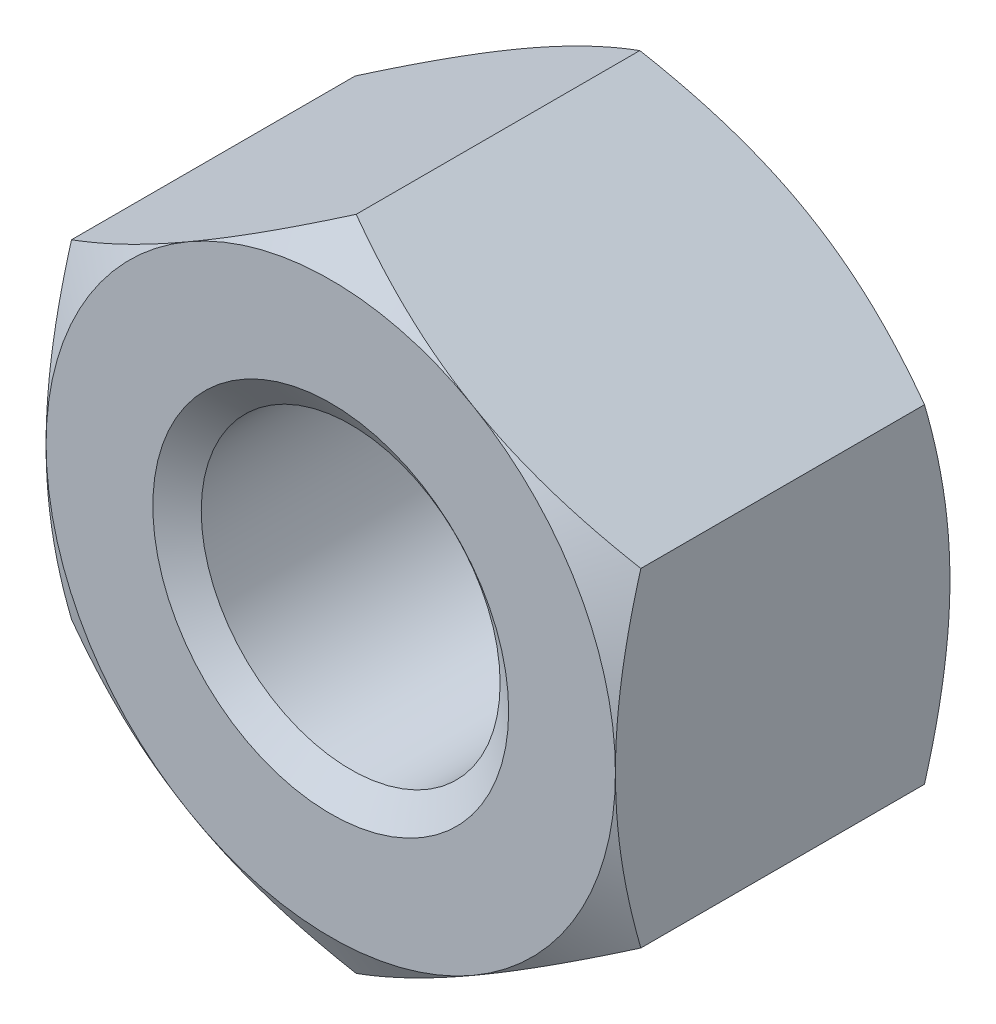
ISO-10303-21;
HEADER;
FILE_DESCRIPTION(('STEP AP214'),'2;1');
FILE_NAME('part.step','',(''),(''),'','','');
FILE_SCHEMA(('AUTOMOTIVE_DESIGN { 1 0 10303 214 1 1 1 1 }'));
ENDSEC;
DATA;
#1=APPLICATION_CONTEXT('core data for automotive mechanical design processes');
#2=APPLICATION_PROTOCOL_DEFINITION('international standard','automotive_design',2000,#1);
#3=PRODUCT_CONTEXT('',#1,'mechanical');
#4=PRODUCT('Part','Part','',(#3));
#5=PRODUCT_RELATED_PRODUCT_CATEGORY('part','',(#4));
#6=PRODUCT_DEFINITION_FORMATION('','',#4);
#7=PRODUCT_DEFINITION_CONTEXT('part definition',#1,'design');
#8=PRODUCT_DEFINITION('design','',#6,#7);
#9=PRODUCT_DEFINITION_SHAPE('','',#8);
#10=(LENGTH_UNIT() NAMED_UNIT(*) SI_UNIT(.MILLI.,.METRE.));
#11=(NAMED_UNIT(*) PLANE_ANGLE_UNIT() SI_UNIT($,.RADIAN.));
#12=(NAMED_UNIT(*) SI_UNIT($,.STERADIAN.) SOLID_ANGLE_UNIT());
#13=UNCERTAINTY_MEASURE_WITH_UNIT(LENGTH_MEASURE(1.E-05),#10,'distance_accuracy_value','');
#14=(GEOMETRIC_REPRESENTATION_CONTEXT(3) GLOBAL_UNCERTAINTY_ASSIGNED_CONTEXT((#13)) GLOBAL_UNIT_ASSIGNED_CONTEXT((#10,
#11,#12)) REPRESENTATION_CONTEXT('',''));
#15=CARTESIAN_POINT('',(0.,0.,0.));
#16=DIRECTION('',(0.,0.,1.));
#17=DIRECTION('',(1.,0.,0.));
#18=AXIS2_PLACEMENT_3D('',#15,#16,#17);
#19=CARTESIAN_POINT('',(0.,0.,-4.7));
#20=DIRECTION('',(0.,0.,1.));
#21=DIRECTION('',(1.,0.,0.));
#22=AXIS2_PLACEMENT_3D('',#19,#20,#21);
#23=CYLINDRICAL_SURFACE('',#22,2.1);
#24=CARTESIAN_POINT('',(0.,0.,-0.280083015283882));
#25=DIRECTION('',(0.,0.,1.));
#26=DIRECTION('',(1.,0.,0.));
#27=AXIS2_PLACEMENT_3D('',#24,#25,#26);
#28=CIRCLE('',#27,2.1);
#29=CARTESIAN_POINT('',(2.1,0.,-0.280083015283882));
#30=VERTEX_POINT('',#29);
#31=EDGE_CURVE('E174',#30,#30,#28,.F.);
#32=ORIENTED_EDGE('',*,*,#31,.F.);
#33=EDGE_LOOP('',(#32));
#34=FACE_BOUND('',#33,.T.);
#35=CARTESIAN_POINT('',(0.,0.,-4.39451698471611));
#36=DIRECTION('',(0.,0.,-1.));
#37=DIRECTION('',(-1.,0.,0.));
#38=AXIS2_PLACEMENT_3D('',#35,#36,#37);
#39=CIRCLE('',#38,2.1);
#40=CARTESIAN_POINT('',(-2.1,0.,-4.39451698471611));
#41=VERTEX_POINT('',#40);
#42=EDGE_CURVE('E39',#41,#41,#39,.F.);
#43=ORIENTED_EDGE('',*,*,#42,.F.);
#44=EDGE_LOOP('',(#43));
#45=FACE_BOUND('',#44,.T.);
#46=ADVANCED_FACE('F34',(#34,#45),#23,.F.);
#47=CARTESIAN_POINT('',(0.,4.61880215351701,-4.7));
#48=DIRECTION('',(-0.500000000000002,0.866025403784438,0.));
#49=DIRECTION('',(-0.866025403784438,-0.500000000000002,0.));
#50=AXIS2_PLACEMENT_3D('',#47,#48,#49);
#51=PLANE('',#50);
#52=DIRECTION('',(0.,0.,1.));
#53=VECTOR('',#52,1.);
#54=CARTESIAN_POINT('',(-4.,2.3094010767585,-4.7));
#55=LINE('',#54,#53);
#56=CARTESIAN_POINT('',(-4.,2.30940107675851,-4.34273441009183));
#57=VERTEX_POINT('',#56);
#58=CARTESIAN_POINT('',(-4.,2.3094010767585,-0.357265589908164));
#59=VERTEX_POINT('',#58);
#60=EDGE_CURVE('E164',#57,#59,#55,.T.);
#61=ORIENTED_EDGE('',*,*,#60,.T.);
#62=CARTESIAN_POINT('',(-4.0002,2.30928560670466,-0.357332259074768));
#63=CARTESIAN_POINT('',(-3.82442084967677,2.4107717464617,-0.298717873648284));
#64=CARTESIAN_POINT('',(-3.64712438367362,2.51313390883499,-0.245410321462263));
#65=CARTESIAN_POINT('',(-3.28946140682429,2.71963072479811,-0.152361670746403));
#66=CARTESIAN_POINT('',(-3.10908854102985,2.82376904741904,-0.112653489029704));
#67=CARTESIAN_POINT('',(-2.75057818129721,3.03075510011795,-0.0508422152802782));
#68=CARTESIAN_POINT('',(-2.57249584706486,3.13357098372491,-0.028327731522888));
#69=CARTESIAN_POINT('',(-2.21549328283349,3.33968651028528,-0.00145062314658112));
#70=CARTESIAN_POINT('',(-2.0365743503559,3.44298540411434,0.00293425857305734));
#71=CARTESIAN_POINT('',(-1.70225715780327,3.63600352522932,-0.00619007293997009));
#72=CARTESIAN_POINT('',(-1.54680884001293,3.72575165335065,-0.0174589539879943));
#73=CARTESIAN_POINT('',(-1.23692494436494,3.90466320392054,-0.0531739907981942));
#74=CARTESIAN_POINT('',(-1.08249043825587,3.99382600759479,-0.0776323457115348));
#75=CARTESIAN_POINT('',(-0.771967672225422,4.17310641015197,-0.138776064919292));
#76=CARTESIAN_POINT('',(-0.615918711936898,4.26320131938131,-0.175720603654867));
#77=CARTESIAN_POINT('',(-0.306148164596161,4.44204742827551,-0.259570072548031));
#78=CARTESIAN_POINT('',(-0.152422609226221,4.53080091904967,-0.306455302212745));
#79=CARTESIAN_POINT('',(0.000199999999999767,4.61891762357085,-0.357332259074773));
#80=B_SPLINE_CURVE_WITH_KNOTS('',3,(#62,#63,#64,#65,#66,#67,#68,#69,#70,#71,#72,#73,#74,#75,#76,
#77,#78,#79),.UNSPECIFIED.,.F.,.F.,(4,2,2,2,2,2,2,2,4),(0.,0.634047835695967,1.26961969224544,
1.88946157213122,2.50854226669297,3.04757825393386,3.58711366126904,4.13861653143764,
4.68903648037744),.UNSPECIFIED.);
#81=CARTESIAN_POINT('',(-2.00000000000001,3.46410161513775,0.));
#82=VERTEX_POINT('',#81);
#83=EDGE_CURVE('E133',#59,#82,#80,.T.);
#84=ORIENTED_EDGE('',*,*,#83,.T.);
#85=CARTESIAN_POINT('',(0.,4.61880215351701,-0.357265589908169));
#86=VERTEX_POINT('',#85);
#87=EDGE_CURVE('E53',#82,#86,#80,.T.);
#88=ORIENTED_EDGE('',*,*,#87,.T.);
#89=DIRECTION('',(0.,0.,1.));
#90=VECTOR('',#89,1.);
#91=CARTESIAN_POINT('',(0.,4.61880215351701,-4.7));
#92=LINE('',#91,#90);
#93=CARTESIAN_POINT('',(0.,4.61880215351701,-4.34273441009183));
#94=VERTEX_POINT('',#93);
#95=EDGE_CURVE('E149',#94,#86,#92,.T.);
#96=ORIENTED_EDGE('',*,*,#95,.F.);
#97=CARTESIAN_POINT('',(-4.0002,2.30928560670466,-4.34266774092523));
#98=CARTESIAN_POINT('',(-3.82442084967677,2.4107717464617,-4.40128212635172));
#99=CARTESIAN_POINT('',(-3.64712438367362,2.51313390883499,-4.45458967853774));
#100=CARTESIAN_POINT('',(-3.28946140682429,2.71963072479811,-4.5476383292536));
#101=CARTESIAN_POINT('',(-3.10908854102985,2.82376904741904,-4.5873465109703));
#102=CARTESIAN_POINT('',(-2.75057818129721,3.03075510011795,-4.64915778471972));
#103=CARTESIAN_POINT('',(-2.57249584706486,3.13357098372491,-4.67167226847711));
#104=CARTESIAN_POINT('',(-2.21549328283349,3.33968651028528,-4.69854937685342));
#105=CARTESIAN_POINT('',(-2.0365743503559,3.44298540411434,-4.70293425857306));
#106=CARTESIAN_POINT('',(-1.70225715780327,3.63600352522932,-4.69380992706003));
#107=CARTESIAN_POINT('',(-1.54680884001293,3.72575165335065,-4.68254104601201));
#108=CARTESIAN_POINT('',(-1.23692494436494,3.90466320392054,-4.64682600920181));
#109=CARTESIAN_POINT('',(-1.08249043825587,3.99382600759479,-4.62236765428847));
#110=CARTESIAN_POINT('',(-0.771967672225422,4.17310641015197,-4.56122393508071));
#111=CARTESIAN_POINT('',(-0.615918711936898,4.26320131938131,-4.52427939634513));
#112=CARTESIAN_POINT('',(-0.30614816459616,4.44204742827551,-4.44042992745197));
#113=CARTESIAN_POINT('',(-0.152422609226221,4.53080091904967,-4.39354469778725));
#114=CARTESIAN_POINT('',(0.000199999999999772,4.61891762357085,-4.34266774092523));
#115=B_SPLINE_CURVE_WITH_KNOTS('',3,(#97,#98,#99,#100,#101,#102,#103,#104,#105,#106,#107,#108,
#109,#110,#111,#112,#113,#114),.UNSPECIFIED.,.F.,.F.,(4,2,2,2,2,2,2,2,4),(0.,0.634047835695967,
1.26961969224544,1.88946157213122,2.50854226669297,3.04757825393386,3.58711366126904,
4.13861653143764,4.68903648037744),.UNSPECIFIED.);
#116=CARTESIAN_POINT('',(-2.00000000000001,3.46410161513775,-4.7));
#117=VERTEX_POINT('',#116);
#118=EDGE_CURVE('E167',#117,#94,#115,.T.);
#119=ORIENTED_EDGE('',*,*,#118,.F.);
#120=EDGE_CURVE('E259',#57,#117,#115,.T.);
#121=ORIENTED_EDGE('',*,*,#120,.F.);
#122=EDGE_LOOP('',(#61,#84,#88,#96,#119,#121));
#123=FACE_BOUND('',#122,.T.);
#124=ADVANCED_FACE('F36',(#123),#51,.T.);
#125=CARTESIAN_POINT('',(4.,2.3094010767585,-4.7));
#126=DIRECTION('',(0.500000000000002,0.866025403784438,0.));
#127=DIRECTION('',(-0.866025403784438,0.500000000000002,0.));
#128=AXIS2_PLACEMENT_3D('',#125,#126,#127);
#129=PLANE('',#128);
#130=ORIENTED_EDGE('',*,*,#95,.T.);
#131=CARTESIAN_POINT('',(-0.000199999999999704,4.61891762357085,-0.357332259074773));
#132=CARTESIAN_POINT('',(0.175579150323228,4.51743148381381,-0.298717873648288));
#133=CARTESIAN_POINT('',(0.352875616326381,4.41506932144052,-0.245410321462267));
#134=CARTESIAN_POINT('',(0.710538593175707,4.2085725054774,-0.152361670746406));
#135=CARTESIAN_POINT('',(0.890911458970152,4.10443418285647,-0.112653489029706));
#136=CARTESIAN_POINT('',(1.24942181870279,3.89744813015756,-0.0508422152802795));
#137=CARTESIAN_POINT('',(1.42750415293514,3.79463224655059,-0.0283277315228889));
#138=CARTESIAN_POINT('',(1.78450671716651,3.58851671999023,-0.00145062314658151));
#139=CARTESIAN_POINT('',(1.9634256496441,3.48521782616117,0.00293425857305701));
#140=CARTESIAN_POINT('',(2.29774284219674,3.29219970504619,-0.00619007293996992));
#141=CARTESIAN_POINT('',(2.45319115998707,3.20245157692486,-0.0174589539879937));
#142=CARTESIAN_POINT('',(2.76307505563506,3.02354002635496,-0.0531739907981926));
#143=CARTESIAN_POINT('',(2.91750956174413,2.93437722268072,-0.0776323457115326));
#144=CARTESIAN_POINT('',(3.22803232777458,2.75509682012354,-0.138776064919289));
#145=CARTESIAN_POINT('',(3.3840812880631,2.66500191089419,-0.175720603654864));
#146=CARTESIAN_POINT('',(3.69385183540384,2.486155802,-0.259570072548028));
#147=CARTESIAN_POINT('',(3.84757739077378,2.39740231122584,-0.306455302212741));
#148=CARTESIAN_POINT('',(4.0002,2.30928560670466,-0.357332259074769));
#149=B_SPLINE_CURVE_WITH_KNOTS('',3,(#131,#132,#133,#134,#135,#136,#137,#138,#139,#140,#141,
#142,#143,#144,#145,#146,#147,#148),.UNSPECIFIED.,.F.,.F.,(4,2,2,2,2,2,2,2,4),(0.,
0.634047835695967,1.26961969224544,1.88946157213123,2.50854226669298,3.04757825393386,
3.58711366126904,4.13861653143764,4.68903648037744),.UNSPECIFIED.);
#150=CARTESIAN_POINT('',(2.00000000000001,3.46410161513775,0.));
#151=VERTEX_POINT('',#150);
#152=EDGE_CURVE('E143',#86,#151,#149,.T.);
#153=ORIENTED_EDGE('',*,*,#152,.T.);
#154=CARTESIAN_POINT('',(4.,2.30940107675851,-0.357265589908169));
#155=VERTEX_POINT('',#154);
#156=EDGE_CURVE('E60',#151,#155,#149,.T.);
#157=ORIENTED_EDGE('',*,*,#156,.T.);
#158=DIRECTION('',(0.,0.,1.));
#159=VECTOR('',#158,1.);
#160=CARTESIAN_POINT('',(4.,2.3094010767585,-4.7));
#161=LINE('',#160,#159);
#162=CARTESIAN_POINT('',(4.,2.30940107675851,-4.34273441009183));
#163=VERTEX_POINT('',#162);
#164=EDGE_CURVE('E142',#163,#155,#161,.T.);
#165=ORIENTED_EDGE('',*,*,#164,.F.);
#166=CARTESIAN_POINT('',(-0.000199999999999913,4.61891762357085,-4.34266774092523));
#167=CARTESIAN_POINT('',(0.175579150323229,4.51743148381381,-4.40128212635171));
#168=CARTESIAN_POINT('',(0.352875616326382,4.41506932144052,-4.45458967853773));
#169=CARTESIAN_POINT('',(0.710538593175708,4.2085725054774,-4.54763832925359));
#170=CARTESIAN_POINT('',(0.890911458970152,4.10443418285647,-4.58734651097029));
#171=CARTESIAN_POINT('',(1.24942181870279,3.89744813015756,-4.64915778471972));
#172=CARTESIAN_POINT('',(1.42750415293514,3.79463224655059,-4.67167226847711));
#173=CARTESIAN_POINT('',(1.78450671716651,3.58851671999023,-4.69854937685342));
#174=CARTESIAN_POINT('',(1.9634256496441,3.48521782616117,-4.70293425857306));
#175=CARTESIAN_POINT('',(2.29774284219674,3.29219970504619,-4.69380992706003));
#176=CARTESIAN_POINT('',(2.45319115998707,3.20245157692486,-4.68254104601201));
#177=CARTESIAN_POINT('',(2.76307505563506,3.02354002635496,-4.64682600920181));
#178=CARTESIAN_POINT('',(2.91750956174413,2.93437722268072,-4.62236765428847));
#179=CARTESIAN_POINT('',(3.22803232777458,2.75509682012354,-4.56122393508071));
#180=CARTESIAN_POINT('',(3.3840812880631,2.66500191089419,-4.52427939634514));
#181=CARTESIAN_POINT('',(3.69385183540384,2.486155802,-4.44042992745197));
#182=CARTESIAN_POINT('',(3.84757739077378,2.39740231122584,-4.39354469778726));
#183=CARTESIAN_POINT('',(4.0002,2.30928560670466,-4.34266774092523));
#184=B_SPLINE_CURVE_WITH_KNOTS('',3,(#166,#167,#168,#169,#170,#171,#172,#173,#174,#175,#176,
#177,#178,#179,#180,#181,#182,#183),.UNSPECIFIED.,.F.,.F.,(4,2,2,2,2,2,2,2,4),(0.,
0.634047835695968,1.26961969224544,1.88946157213123,2.50854226669298,3.04757825393386,
3.58711366126904,4.13861653143764,4.68903648037744),.UNSPECIFIED.);
#185=CARTESIAN_POINT('',(2.00000000000001,3.46410161513775,-4.7));
#186=VERTEX_POINT('',#185);
#187=EDGE_CURVE('E253',#186,#163,#184,.T.);
#188=ORIENTED_EDGE('',*,*,#187,.F.);
#189=EDGE_CURVE('E258',#94,#186,#184,.T.);
#190=ORIENTED_EDGE('',*,*,#189,.F.);
#191=EDGE_LOOP('',(#130,#153,#157,#165,#188,#190));
#192=FACE_BOUND('',#191,.T.);
#193=ADVANCED_FACE('F140',(#192),#129,.T.);
#194=CARTESIAN_POINT('',(4.,2.3094010767585,-4.7));
#195=DIRECTION('',(-1.,0.,0.));
#196=DIRECTION('',(0.,0.,1.));
#197=AXIS2_PLACEMENT_3D('',#194,#195,#196);
#198=PLANE('',#197);
#199=CARTESIAN_POINT('',(4.,-6.12487198995893,-1.91410682124065));
#200=CARTESIAN_POINT('',(4.,-5.94924937038677,-1.82923627076691));
#201=CARTESIAN_POINT('',(4.,-5.77321152095287,-1.74520940380741));
#202=CARTESIAN_POINT('',(4.,-5.42008084777955,-1.57932514679717));
#203=CARTESIAN_POINT('',(4.,-5.24298784779928,-1.49746813236724));
#204=CARTESIAN_POINT('',(4.,-4.88656571686334,-1.33597446305857));
#205=CARTESIAN_POINT('',(4.,-4.70722958889363,-1.25635319506305));
#206=CARTESIAN_POINT('',(4.,-4.34708334747264,-1.1005305854203));
#207=CARTESIAN_POINT('',(4.,-4.16627331143538,-1.02432906550803));
#208=CARTESIAN_POINT('',(4.,-3.80064706744978,-0.875350650394368));
#209=CARTESIAN_POINT('',(4.,-3.6158089282277,-0.802627284215851));
#210=CARTESIAN_POINT('',(4.,-3.24395246794969,-0.662876230959424));
#211=CARTESIAN_POINT('',(4.,-3.05693390695802,-0.595849177566508));
#212=CARTESIAN_POINT('',(4.,-2.68080318253771,-0.469291748430885));
#213=CARTESIAN_POINT('',(4.,-2.49169643712849,-0.409745434783841));
#214=CARTESIAN_POINT('',(4.,-2.11079454635852,-0.300083356544509));
#215=CARTESIAN_POINT('',(4.,-1.91900027185749,-0.249964609676754));
#216=CARTESIAN_POINT('',(4.,-1.532592326982,-0.161590794954043));
#217=CARTESIAN_POINT('',(4.,-1.3379779203165,-0.123338885956541));
#218=CARTESIAN_POINT('',(4.,-0.946402725872557,-0.0612742359223443));
#219=CARTESIAN_POINT('',(4.,-0.749441936019777,-0.0374615076516996));
#220=CARTESIAN_POINT('',(4.,-0.355451989627945,-0.00638181314943657));
#221=CARTESIAN_POINT('',(4.,-0.158431311094014,0.000989900761041172));
#222=CARTESIAN_POINT('',(4.,0.235472085607467,-0.0012040663747957));
#223=CARTESIAN_POINT('',(4.,0.432354826312203,-0.0107653508153508));
#224=CARTESIAN_POINT('',(4.,0.768560635225514,-0.040878734613591));
#225=CARTESIAN_POINT('',(4.,0.908254618381816,-0.0575092960439102));
#226=CARTESIAN_POINT('',(4.,1.18656349063497,-0.0982134103466921));
#227=CARTESIAN_POINT('',(4.,1.32517820601013,-0.122288137058446));
#228=CARTESIAN_POINT('',(4.,1.73929045452969,-0.204415070950231));
#229=CARTESIAN_POINT('',(4.,2.01284690528721,-0.272348886425153));
#230=CARTESIAN_POINT('',(4.,2.42218253014523,-0.389516359317203));
#231=CARTESIAN_POINT('',(4.,2.56009536361537,-0.431713941811636));
#232=CARTESIAN_POINT('',(4.,2.83448159101402,-0.520284580227761));
#233=CARTESIAN_POINT('',(4.,2.97095590623556,-0.566654756186911));
#234=CARTESIAN_POINT('',(4.,3.24189440516339,-0.662605699180285));
#235=CARTESIAN_POINT('',(4.,3.37636557946837,-0.712166925753499));
#236=CARTESIAN_POINT('',(4.,3.64426461152912,-0.8141983537907));
#237=CARTESIAN_POINT('',(4.,3.77769202239385,-0.866669730963367));
#238=CARTESIAN_POINT('',(4.,3.91063698986682,-0.92030900654179));
#239=B_SPLINE_CURVE_WITH_KNOTS('',3,(#199,#200,#201,#202,#203,#204,#205,#206,#207,#208,#209,
#210,#211,#212,#213,#214,#215,#216,#217,#218,#219,#220,#221,#222,#223,#224,#225,#226,#227,#228,
#229,#230,#231,#232,#233,#234,#235,#236,#237,#238),.UNSPECIFIED.,.F.,.F.,(4,2,2,2,2,2,2,2,2,2,2,
2,2,2,2,2,2,2,2,4),(0.,0.585171792532272,1.17044423059927,1.7590659464599,2.34765694284827,
2.94347400997484,3.53935727210689,4.13394864697601,4.72835161391471,5.32291267067846,
5.91747425310813,6.50823685854037,7.09884609659887,7.52068140825522,7.9425832713084,
8.78701491359829,9.21965281897689,9.65199437116297,10.0819024146297,10.5119854255247),.UNSPECIFIED.);
#240=CARTESIAN_POINT('',(4.,-2.30940107675851,-0.357265589908169));
#241=VERTEX_POINT('',#240);
#242=CARTESIAN_POINT('',(4.,0.,0.));
#243=VERTEX_POINT('',#242);
#244=EDGE_CURVE('E135',#241,#243,#239,.T.);
#245=ORIENTED_EDGE('',*,*,#244,.F.);
#246=DIRECTION('',(0.,0.,1.));
#247=VECTOR('',#246,1.);
#248=CARTESIAN_POINT('',(4.,-2.30940107675851,-4.7));
#249=LINE('',#248,#247);
#250=CARTESIAN_POINT('',(4.,-2.30940107675851,-4.34273441009183));
#251=VERTEX_POINT('',#250);
#252=EDGE_CURVE('E150',#251,#241,#249,.T.);
#253=ORIENTED_EDGE('',*,*,#252,.F.);
#254=CARTESIAN_POINT('',(4.,-6.12487198995893,-2.78589317875935));
#255=CARTESIAN_POINT('',(4.,-5.94924937038677,-2.87076372923309));
#256=CARTESIAN_POINT('',(4.,-5.77321152095287,-2.95479059619259));
#257=CARTESIAN_POINT('',(4.,-5.42008084777955,-3.12067485320283));
#258=CARTESIAN_POINT('',(4.,-5.24298784779928,-3.20253186763276));
#259=CARTESIAN_POINT('',(4.,-4.88656571686334,-3.36402553694143));
#260=CARTESIAN_POINT('',(4.,-4.70722958889363,-3.44364680493695));
#261=CARTESIAN_POINT('',(4.,-4.34708334747264,-3.5994694145797));
#262=CARTESIAN_POINT('',(4.,-4.16627331143538,-3.67567093449197));
#263=CARTESIAN_POINT('',(4.,-3.80064706744978,-3.82464934960563));
#264=CARTESIAN_POINT('',(4.,-3.6158089282277,-3.89737271578415));
#265=CARTESIAN_POINT('',(4.,-3.24395246794969,-4.03712376904058));
#266=CARTESIAN_POINT('',(4.,-3.05693390695802,-4.10415082243349));
#267=CARTESIAN_POINT('',(4.,-2.68080318253771,-4.23070825156911));
#268=CARTESIAN_POINT('',(4.,-2.49169643712849,-4.29025456521616));
#269=CARTESIAN_POINT('',(4.,-2.11079454635851,-4.39991664345549));
#270=CARTESIAN_POINT('',(4.,-1.91900027185749,-4.45003539032325));
#271=CARTESIAN_POINT('',(4.,-1.532592326982,-4.53840920504596));
#272=CARTESIAN_POINT('',(4.,-1.3379779203165,-4.57666111404346));
#273=CARTESIAN_POINT('',(4.,-0.946402725872557,-4.63872576407766));
#274=CARTESIAN_POINT('',(4.,-0.749441936019777,-4.6625384923483));
#275=CARTESIAN_POINT('',(4.,-0.355451989627945,-4.69361818685056));
#276=CARTESIAN_POINT('',(4.,-0.158431311094013,-4.70098990076104));
#277=CARTESIAN_POINT('',(4.,0.235472085607467,-4.6987959336252));
#278=CARTESIAN_POINT('',(4.,0.432354826312203,-4.68923464918465));
#279=CARTESIAN_POINT('',(4.,0.768560635225514,-4.65912126538641));
#280=CARTESIAN_POINT('',(4.,0.908254618381816,-4.64249070395609));
#281=CARTESIAN_POINT('',(4.,1.18656349063497,-4.60178658965331));
#282=CARTESIAN_POINT('',(4.,1.32517820601013,-4.57771186294155));
#283=CARTESIAN_POINT('',(4.,1.73929045452969,-4.49558492904977));
#284=CARTESIAN_POINT('',(4.,2.01284690528721,-4.42765111357485));
#285=CARTESIAN_POINT('',(4.,2.42218253014523,-4.3104836406828));
#286=CARTESIAN_POINT('',(4.,2.56009536361537,-4.26828605818837));
#287=CARTESIAN_POINT('',(4.,2.83448159101402,-4.17971541977224));
#288=CARTESIAN_POINT('',(4.,2.97095590623556,-4.13334524381309));
#289=CARTESIAN_POINT('',(4.,3.24189440516339,-4.03739430081972));
#290=CARTESIAN_POINT('',(4.,3.37636557946836,-3.9878330742465));
#291=CARTESIAN_POINT('',(4.,3.64426461152912,-3.8858016462093));
#292=CARTESIAN_POINT('',(4.,3.77769202239385,-3.83333026903663));
#293=CARTESIAN_POINT('',(4.,3.91063698986682,-3.77969099345821));
#294=B_SPLINE_CURVE_WITH_KNOTS('',3,(#254,#255,#256,#257,#258,#259,#260,#261,#262,#263,#264,
#265,#266,#267,#268,#269,#270,#271,#272,#273,#274,#275,#276,#277,#278,#279,#280,#281,#282,#283,
#284,#285,#286,#287,#288,#289,#290,#291,#292,#293),.UNSPECIFIED.,.F.,.F.,(4,2,2,2,2,2,2,2,2,2,2,
2,2,2,2,2,2,2,2,4),(0.,0.585171792532271,1.17044423059927,1.7590659464599,2.34765694284827,
2.94347400997484,3.53935727210689,4.13394864697601,4.72835161391471,5.32291267067846,
5.91747425310813,6.50823685854037,7.09884609659887,7.52068140825522,7.9425832713084,
8.78701491359829,9.21965281897689,9.65199437116297,10.0819024146297,10.5119854255247),.UNSPECIFIED.);
#295=CARTESIAN_POINT('',(4.,0.,-4.7));
#296=VERTEX_POINT('',#295);
#297=EDGE_CURVE('E265',#251,#296,#294,.T.);
#298=ORIENTED_EDGE('',*,*,#297,.T.);
#299=EDGE_CURVE('E148',#296,#163,#294,.T.);
#300=ORIENTED_EDGE('',*,*,#299,.T.);
#301=ORIENTED_EDGE('',*,*,#164,.T.);
#302=EDGE_CURVE('E125',#243,#155,#239,.T.);
#303=ORIENTED_EDGE('',*,*,#302,.F.);
#304=EDGE_LOOP('',(#245,#253,#298,#300,#301,#303));
#305=FACE_BOUND('',#304,.T.);
#306=ADVANCED_FACE('F146',(#305),#198,.F.);
#307=CARTESIAN_POINT('',(0.,-4.61880215351702,-4.7));
#308=DIRECTION('',(0.500000000000001,-0.866025403784438,0.));
#309=DIRECTION('',(0.866025403784438,0.500000000000001,0.));
#310=AXIS2_PLACEMENT_3D('',#307,#308,#309);
#311=PLANE('',#310);
#312=ORIENTED_EDGE('',*,*,#252,.T.);
#313=CARTESIAN_POINT('',(4.0002,-2.30928560670467,-0.357332259074773));
#314=CARTESIAN_POINT('',(3.82442084967677,-2.41077174646172,-0.298717873648288));
#315=CARTESIAN_POINT('',(3.64712438367362,-2.51313390883501,-0.245410321462268));
#316=CARTESIAN_POINT('',(3.28946140682429,-2.71963072479813,-0.152361670746409));
#317=CARTESIAN_POINT('',(3.10908854102985,-2.82376904741905,-0.112653489029709));
#318=CARTESIAN_POINT('',(2.75057818129721,-3.03075510011796,-0.0508422152802842));
#319=CARTESIAN_POINT('',(2.57249584706485,-3.13357098372493,-0.0283277315228942));
#320=CARTESIAN_POINT('',(2.21549328283349,-3.3396865102853,-0.00145062314658794));
#321=CARTESIAN_POINT('',(2.0365743503559,-3.44298540411436,0.00293425857305012));
#322=CARTESIAN_POINT('',(1.70225715780326,-3.63600352522934,-0.00619007293997785));
#323=CARTESIAN_POINT('',(1.54680884001293,-3.72575165335066,-0.0174589539880022));
#324=CARTESIAN_POINT('',(1.23692494436494,-3.90466320392056,-0.0531739907982021));
#325=CARTESIAN_POINT('',(1.08249043825587,-3.9938260075948,-0.0776323457115426));
#326=CARTESIAN_POINT('',(0.77196767222542,-4.17310641015199,-0.1387760649193));
#327=CARTESIAN_POINT('',(0.615918711936896,-4.26320131938133,-0.175720603654875));
#328=CARTESIAN_POINT('',(0.30614816459616,-4.44204742827552,-0.25957007254804));
#329=CARTESIAN_POINT('',(0.15242260922622,-4.53080091904968,-0.306455302212753));
#330=CARTESIAN_POINT('',(-0.000199999999999865,-4.61891762357086,-0.357332259074781));
#331=B_SPLINE_CURVE_WITH_KNOTS('',3,(#313,#314,#315,#316,#317,#318,#319,#320,#321,#322,#323,
#324,#325,#326,#327,#328,#329,#330),.UNSPECIFIED.,.F.,.F.,(4,2,2,2,2,2,2,2,4),(0.,
0.634047835695968,1.26961969224544,1.88946157213123,2.50854226669298,3.04757825393386,
3.58711366126904,4.13861653143764,4.68903648037744),.UNSPECIFIED.);
#332=CARTESIAN_POINT('',(2.00000000000001,-3.46410161513775,0.));
#333=VERTEX_POINT('',#332);
#334=EDGE_CURVE('E359',#241,#333,#331,.T.);
#335=ORIENTED_EDGE('',*,*,#334,.T.);
#336=CARTESIAN_POINT('',(0.,-4.61880215351701,-0.357265589908169));
#337=VERTEX_POINT('',#336);
#338=EDGE_CURVE('E225',#333,#337,#331,.T.);
#339=ORIENTED_EDGE('',*,*,#338,.T.);
#340=DIRECTION('',(0.,0.,1.));
#341=VECTOR('',#340,1.);
#342=CARTESIAN_POINT('',(0.,-4.61880215351702,-4.7));
#343=LINE('',#342,#341);
#344=CARTESIAN_POINT('',(0.,-4.61880215351701,-4.34273441009183));
#345=VERTEX_POINT('',#344);
#346=EDGE_CURVE('E155',#345,#337,#343,.T.);
#347=ORIENTED_EDGE('',*,*,#346,.F.);
#348=CARTESIAN_POINT('',(4.0002,-2.30928560670467,-4.34266774092523));
#349=CARTESIAN_POINT('',(3.82442084967677,-2.41077174646171,-4.40128212635171));
#350=CARTESIAN_POINT('',(3.64712438367362,-2.513133908835,-4.45458967853773));
#351=CARTESIAN_POINT('',(3.28946140682429,-2.71963072479813,-4.54763832925359));
#352=CARTESIAN_POINT('',(3.10908854102985,-2.82376904741905,-4.58734651097029));
#353=CARTESIAN_POINT('',(2.75057818129721,-3.03075510011796,-4.64915778471972));
#354=CARTESIAN_POINT('',(2.57249584706485,-3.13357098372493,-4.67167226847711));
#355=CARTESIAN_POINT('',(2.21549328283349,-3.3396865102853,-4.69854937685341));
#356=CARTESIAN_POINT('',(2.0365743503559,-3.44298540411436,-4.70293425857305));
#357=CARTESIAN_POINT('',(1.70225715780326,-3.63600352522934,-4.69380992706002));
#358=CARTESIAN_POINT('',(1.54680884001293,-3.72575165335066,-4.682541046012));
#359=CARTESIAN_POINT('',(1.23692494436494,-3.90466320392056,-4.6468260092018));
#360=CARTESIAN_POINT('',(1.08249043825587,-3.9938260075948,-4.62236765428846));
#361=CARTESIAN_POINT('',(0.77196767222542,-4.17310641015199,-4.5612239350807));
#362=CARTESIAN_POINT('',(0.615918711936896,-4.26320131938133,-4.52427939634512));
#363=CARTESIAN_POINT('',(0.30614816459616,-4.44204742827552,-4.44042992745196));
#364=CARTESIAN_POINT('',(0.15242260922622,-4.53080091904968,-4.39354469778725));
#365=CARTESIAN_POINT('',(-0.000199999999999872,-4.61891762357086,-4.34266774092522));
#366=B_SPLINE_CURVE_WITH_KNOTS('',3,(#348,#349,#350,#351,#352,#353,#354,#355,#356,#357,#358,
#359,#360,#361,#362,#363,#364,#365),.UNSPECIFIED.,.F.,.F.,(4,2,2,2,2,2,2,2,4),(0.,
0.634047835695968,1.26961969224544,1.88946157213123,2.50854226669298,3.04757825393386,
3.58711366126904,4.13861653143764,4.68903648037744),.UNSPECIFIED.);
#367=CARTESIAN_POINT('',(2.00000000000001,-3.46410161513775,-4.7));
#368=VERTEX_POINT('',#367);
#369=EDGE_CURVE('E271',#368,#345,#366,.T.);
#370=ORIENTED_EDGE('',*,*,#369,.F.);
#371=EDGE_CURVE('E270',#251,#368,#366,.T.);
#372=ORIENTED_EDGE('',*,*,#371,.F.);
#373=EDGE_LOOP('',(#312,#335,#339,#347,#370,#372));
#374=FACE_BOUND('',#373,.T.);
#375=ADVANCED_FACE('F281',(#374),#311,.T.);
#376=CARTESIAN_POINT('',(-4.,-2.30940107675851,-4.7));
#377=DIRECTION('',(-0.500000000000001,-0.866025403784438,0.));
#378=DIRECTION('',(0.866025403784438,-0.500000000000001,0.));
#379=AXIS2_PLACEMENT_3D('',#376,#377,#378);
#380=PLANE('',#379);
#381=ORIENTED_EDGE('',*,*,#346,.T.);
#382=CARTESIAN_POINT('',(0.00020000000000025,-4.61891762357086,-0.357332259074781));
#383=CARTESIAN_POINT('',(-0.175579150323229,-4.51743148381382,-0.298717873648296));
#384=CARTESIAN_POINT('',(-0.352875616326382,-4.41506932144053,-0.245410321462275));
#385=CARTESIAN_POINT('',(-0.71053859317571,-4.20857250547741,-0.152361670746414));
#386=CARTESIAN_POINT('',(-0.890911458970155,-4.10443418285648,-0.112653489029713));
#387=CARTESIAN_POINT('',(-1.2494218187028,-3.89744813015757,-0.0508422152802868));
#388=CARTESIAN_POINT('',(-1.42750415293515,-3.7946322465506,-0.0283277315228961));
#389=CARTESIAN_POINT('',(-1.78450671716652,-3.58851671999024,-0.00145062314658831));
#390=CARTESIAN_POINT('',(-1.96342564964411,-3.48521782616118,0.00293425857305054));
#391=CARTESIAN_POINT('',(-2.29774284219674,-3.2921997050462,-0.00619007293997655));
#392=CARTESIAN_POINT('',(-2.45319115998707,-3.20245157692487,-0.0174589539880006));
#393=CARTESIAN_POINT('',(-2.76307505563506,-3.02354002635498,-0.0531739907981996));
#394=CARTESIAN_POINT('',(-2.91750956174414,-2.93437722268073,-0.0776323457115394));
#395=CARTESIAN_POINT('',(-3.22803232777458,-2.75509682012355,-0.138776064919295));
#396=CARTESIAN_POINT('',(-3.38408128806311,-2.66500191089421,-0.175720603654869));
#397=CARTESIAN_POINT('',(-3.69385183540384,-2.48615580200002,-0.259570072548033));
#398=CARTESIAN_POINT('',(-3.84757739077378,-2.39740231122586,-0.306455302212745));
#399=CARTESIAN_POINT('',(-4.0002,-2.30928560670467,-0.357332259074772));
#400=B_SPLINE_CURVE_WITH_KNOTS('',3,(#382,#383,#384,#385,#386,#387,#388,#389,#390,#391,#392,
#393,#394,#395,#396,#397,#398,#399),.UNSPECIFIED.,.F.,.F.,(4,2,2,2,2,2,2,2,4),(0.,
0.63404783569597,1.26961969224544,1.88946157213123,2.50854226669298,3.04757825393387,
3.58711366126904,4.13861653143764,4.68903648037744),.UNSPECIFIED.);
#401=CARTESIAN_POINT('',(-2.00000000000001,-3.46410161513775,0.));
#402=VERTEX_POINT('',#401);
#403=EDGE_CURVE('E356',#337,#402,#400,.T.);
#404=ORIENTED_EDGE('',*,*,#403,.T.);
#405=CARTESIAN_POINT('',(-4.,-2.30940107675851,-0.357265589908169));
#406=VERTEX_POINT('',#405);
#407=EDGE_CURVE('E199',#402,#406,#400,.T.);
#408=ORIENTED_EDGE('',*,*,#407,.T.);
#409=DIRECTION('',(0.,0.,1.));
#410=VECTOR('',#409,1.);
#411=CARTESIAN_POINT('',(-4.,-2.30940107675851,-4.7));
#412=LINE('',#411,#410);
#413=CARTESIAN_POINT('',(-4.,-2.30940107675851,-4.34273441009183));
#414=VERTEX_POINT('',#413);
#415=EDGE_CURVE('E161',#414,#406,#412,.T.);
#416=ORIENTED_EDGE('',*,*,#415,.F.);
#417=CARTESIAN_POINT('',(0.00020000000000025,-4.61891762357086,-4.34266774092522));
#418=CARTESIAN_POINT('',(-0.175579150323228,-4.51743148381382,-4.4012821263517));
#419=CARTESIAN_POINT('',(-0.352875616326382,-4.41506932144053,-4.45458967853773));
#420=CARTESIAN_POINT('',(-0.710538593175709,-4.20857250547741,-4.54763832925359));
#421=CARTESIAN_POINT('',(-0.890911458970155,-4.10443418285648,-4.58734651097029));
#422=CARTESIAN_POINT('',(-1.2494218187028,-3.89744813015757,-4.64915778471971));
#423=CARTESIAN_POINT('',(-1.42750415293515,-3.7946322465506,-4.6716722684771));
#424=CARTESIAN_POINT('',(-1.78450671716652,-3.58851671999024,-4.69854937685341));
#425=CARTESIAN_POINT('',(-1.96342564964411,-3.48521782616118,-4.70293425857305));
#426=CARTESIAN_POINT('',(-2.29774284219674,-3.2921997050462,-4.69380992706002));
#427=CARTESIAN_POINT('',(-2.45319115998707,-3.20245157692487,-4.682541046012));
#428=CARTESIAN_POINT('',(-2.76307505563506,-3.02354002635498,-4.6468260092018));
#429=CARTESIAN_POINT('',(-2.91750956174414,-2.93437722268073,-4.62236765428846));
#430=CARTESIAN_POINT('',(-3.22803232777458,-2.75509682012355,-4.56122393508071));
#431=CARTESIAN_POINT('',(-3.3840812880631,-2.66500191089421,-4.52427939634513));
#432=CARTESIAN_POINT('',(-3.69385183540384,-2.48615580200002,-4.44042992745197));
#433=CARTESIAN_POINT('',(-3.84757739077378,-2.39740231122586,-4.39354469778725));
#434=CARTESIAN_POINT('',(-4.0002,-2.30928560670467,-4.34266774092523));
#435=B_SPLINE_CURVE_WITH_KNOTS('',3,(#417,#418,#419,#420,#421,#422,#423,#424,#425,#426,#427,
#428,#429,#430,#431,#432,#433,#434),.UNSPECIFIED.,.F.,.F.,(4,2,2,2,2,2,2,2,4),(0.,
0.63404783569597,1.26961969224544,1.88946157213123,2.50854226669299,3.04757825393387,
3.58711366126904,4.13861653143764,4.68903648037744),.UNSPECIFIED.);
#436=CARTESIAN_POINT('',(-2.00000000000001,-3.46410161513775,-4.7));
#437=VERTEX_POINT('',#436);
#438=EDGE_CURVE('E277',#437,#414,#435,.T.);
#439=ORIENTED_EDGE('',*,*,#438,.F.);
#440=EDGE_CURVE('E276',#345,#437,#435,.T.);
#441=ORIENTED_EDGE('',*,*,#440,.F.);
#442=EDGE_LOOP('',(#381,#404,#408,#416,#439,#441));
#443=FACE_BOUND('',#442,.T.);
#444=ADVANCED_FACE('F284',(#443),#380,.T.);
#445=CARTESIAN_POINT('',(-4.,2.3094010767585,-4.7));
#446=DIRECTION('',(-1.,0.,0.));
#447=DIRECTION('',(0.,0.,1.));
#448=AXIS2_PLACEMENT_3D('',#445,#446,#447);
#449=PLANE('',#448);
#450=ORIENTED_EDGE('',*,*,#415,.T.);
#451=CARTESIAN_POINT('',(-4.,-6.12487198995893,-1.91410682124065));
#452=CARTESIAN_POINT('',(-4.,-5.94924937038677,-1.82923627076691));
#453=CARTESIAN_POINT('',(-4.,-5.77321152095287,-1.74520940380741));
#454=CARTESIAN_POINT('',(-4.,-5.42008084777955,-1.57932514679717));
#455=CARTESIAN_POINT('',(-4.,-5.24298784779928,-1.49746813236724));
#456=CARTESIAN_POINT('',(-4.,-4.88656571686334,-1.33597446305857));
#457=CARTESIAN_POINT('',(-4.,-4.70722958889363,-1.25635319506305));
#458=CARTESIAN_POINT('',(-4.,-4.34708334747264,-1.10053058542031));
#459=CARTESIAN_POINT('',(-4.,-4.16627331143538,-1.02432906550803));
#460=CARTESIAN_POINT('',(-4.,-3.80064706744978,-0.875350650394369));
#461=CARTESIAN_POINT('',(-4.,-3.6158089282277,-0.802627284215852));
#462=CARTESIAN_POINT('',(-4.,-3.24395246794969,-0.662876230959426));
#463=CARTESIAN_POINT('',(-4.,-3.05693390695802,-0.59584917756651));
#464=CARTESIAN_POINT('',(-4.,-2.68080318253771,-0.469291748430886));
#465=CARTESIAN_POINT('',(-4.,-2.49169643712849,-0.409745434783841));
#466=CARTESIAN_POINT('',(-4.,-2.11079454635852,-0.30008335654451));
#467=CARTESIAN_POINT('',(-4.,-1.91900027185749,-0.249964609676755));
#468=CARTESIAN_POINT('',(-4.,-1.532592326982,-0.161590794954044));
#469=CARTESIAN_POINT('',(-4.,-1.3379779203165,-0.123338885956542));
#470=CARTESIAN_POINT('',(-4.,-0.946402725872559,-0.0612742359223442));
#471=CARTESIAN_POINT('',(-4.,-0.749441936019779,-0.0374615076516996));
#472=CARTESIAN_POINT('',(-4.,-0.355451989627947,-0.00638181314943657));
#473=CARTESIAN_POINT('',(-4.,-0.158431311094015,0.000989900761041205));
#474=CARTESIAN_POINT('',(-4.,0.235472085607465,-0.00120406637479573));
#475=CARTESIAN_POINT('',(-4.,0.432354826312202,-0.010765350815351));
#476=CARTESIAN_POINT('',(-4.,0.768560635225513,-0.0408787346135909));
#477=CARTESIAN_POINT('',(-4.,0.908254618381815,-0.0575092960439097));
#478=CARTESIAN_POINT('',(-4.,1.18656349063497,-0.0982134103466917));
#479=CARTESIAN_POINT('',(-4.,1.32517820601013,-0.122288137058446));
#480=CARTESIAN_POINT('',(-4.,1.73929045452968,-0.204415070950231));
#481=CARTESIAN_POINT('',(-4.,2.01284690528721,-0.272348886425153));
#482=CARTESIAN_POINT('',(-4.,2.42218253014523,-0.389516359317203));
#483=CARTESIAN_POINT('',(-4.,2.56009536361537,-0.431713941811636));
#484=CARTESIAN_POINT('',(-4.,2.83448159101402,-0.520284580227761));
#485=CARTESIAN_POINT('',(-4.,2.97095590623556,-0.566654756186911));
#486=CARTESIAN_POINT('',(-4.,3.24189440516339,-0.662605699180285));
#487=CARTESIAN_POINT('',(-4.,3.37636557946837,-0.712166925753499));
#488=CARTESIAN_POINT('',(-4.,3.64426461152912,-0.8141983537907));
#489=CARTESIAN_POINT('',(-4.,3.77769202239385,-0.866669730963367));
#490=CARTESIAN_POINT('',(-4.,3.91063698986682,-0.92030900654179));
#491=B_SPLINE_CURVE_WITH_KNOTS('',3,(#451,#452,#453,#454,#455,#456,#457,#458,#459,#460,#461,
#462,#463,#464,#465,#466,#467,#468,#469,#470,#471,#472,#473,#474,#475,#476,#477,#478,#479,#480,
#481,#482,#483,#484,#485,#486,#487,#488,#489,#490),.UNSPECIFIED.,.F.,.F.,(4,2,2,2,2,2,2,2,2,2,2,
2,2,2,2,2,2,2,2,4),(0.,0.585171792532273,1.17044423059927,1.7590659464599,2.34765694284827,
2.94347400997484,3.53935727210689,4.13394864697601,4.72835161391472,5.32291267067846,
5.91747425310813,6.50823685854037,7.09884609659887,7.52068140825522,7.9425832713084,
8.7870149135983,9.21965281897689,9.65199437116297,10.0819024146297,10.5119854255247),.UNSPECIFIED.);
#492=CARTESIAN_POINT('',(-4.,0.,0.));
#493=VERTEX_POINT('',#492);
#494=EDGE_CURVE('E198',#406,#493,#491,.T.);
#495=ORIENTED_EDGE('',*,*,#494,.T.);
#496=EDGE_CURVE('E191',#493,#59,#491,.T.);
#497=ORIENTED_EDGE('',*,*,#496,.T.);
#498=ORIENTED_EDGE('',*,*,#60,.F.);
#499=CARTESIAN_POINT('',(-4.,-6.12487198995893,-2.78589317875935));
#500=CARTESIAN_POINT('',(-4.,-5.94924937038677,-2.87076372923309));
#501=CARTESIAN_POINT('',(-4.,-5.77321152095287,-2.95479059619259));
#502=CARTESIAN_POINT('',(-4.,-5.42008084777955,-3.12067485320283));
#503=CARTESIAN_POINT('',(-4.,-5.24298784779928,-3.20253186763276));
#504=CARTESIAN_POINT('',(-4.,-4.88656571686335,-3.36402553694143));
#505=CARTESIAN_POINT('',(-4.,-4.70722958889363,-3.44364680493695));
#506=CARTESIAN_POINT('',(-4.,-4.34708334747264,-3.5994694145797));
#507=CARTESIAN_POINT('',(-4.,-4.16627331143538,-3.67567093449197));
#508=CARTESIAN_POINT('',(-4.,-3.80064706744978,-3.82464934960563));
#509=CARTESIAN_POINT('',(-4.,-3.6158089282277,-3.89737271578415));
#510=CARTESIAN_POINT('',(-4.,-3.24395246794969,-4.03712376904058));
#511=CARTESIAN_POINT('',(-4.,-3.05693390695802,-4.10415082243349));
#512=CARTESIAN_POINT('',(-4.,-2.68080318253771,-4.23070825156911));
#513=CARTESIAN_POINT('',(-4.,-2.49169643712849,-4.29025456521616));
#514=CARTESIAN_POINT('',(-4.,-2.11079454635852,-4.39991664345549));
#515=CARTESIAN_POINT('',(-4.,-1.91900027185749,-4.45003539032325));
#516=CARTESIAN_POINT('',(-4.,-1.532592326982,-4.53840920504596));
#517=CARTESIAN_POINT('',(-4.,-1.3379779203165,-4.57666111404346));
#518=CARTESIAN_POINT('',(-4.,-0.946402725872557,-4.63872576407766));
#519=CARTESIAN_POINT('',(-4.,-0.749441936019777,-4.6625384923483));
#520=CARTESIAN_POINT('',(-4.,-0.355451989627946,-4.69361818685056));
#521=CARTESIAN_POINT('',(-4.,-0.158431311094014,-4.70098990076104));
#522=CARTESIAN_POINT('',(-4.,0.235472085607466,-4.6987959336252));
#523=CARTESIAN_POINT('',(-4.,0.432354826312202,-4.68923464918465));
#524=CARTESIAN_POINT('',(-4.,0.768560635225513,-4.65912126538641));
#525=CARTESIAN_POINT('',(-4.,0.908254618381815,-4.64249070395609));
#526=CARTESIAN_POINT('',(-4.,1.18656349063497,-4.60178658965331));
#527=CARTESIAN_POINT('',(-4.,1.32517820601013,-4.57771186294155));
#528=CARTESIAN_POINT('',(-4.,1.73929045452968,-4.49558492904977));
#529=CARTESIAN_POINT('',(-4.,2.01284690528721,-4.42765111357485));
#530=CARTESIAN_POINT('',(-4.,2.42218253014522,-4.3104836406828));
#531=CARTESIAN_POINT('',(-4.,2.56009536361537,-4.26828605818837));
#532=CARTESIAN_POINT('',(-4.,2.83448159101402,-4.17971541977224));
#533=CARTESIAN_POINT('',(-4.,2.97095590623556,-4.13334524381309));
#534=CARTESIAN_POINT('',(-4.,3.24189440516339,-4.03739430081972));
#535=CARTESIAN_POINT('',(-4.,3.37636557946836,-3.9878330742465));
#536=CARTESIAN_POINT('',(-4.,3.64426461152912,-3.8858016462093));
#537=CARTESIAN_POINT('',(-4.,3.77769202239385,-3.83333026903663));
#538=CARTESIAN_POINT('',(-4.,3.91063698986682,-3.77969099345821));
#539=B_SPLINE_CURVE_WITH_KNOTS('',3,(#499,#500,#501,#502,#503,#504,#505,#506,#507,#508,#509,
#510,#511,#512,#513,#514,#515,#516,#517,#518,#519,#520,#521,#522,#523,#524,#525,#526,#527,#528,
#529,#530,#531,#532,#533,#534,#535,#536,#537,#538),.UNSPECIFIED.,.F.,.F.,(4,2,2,2,2,2,2,2,2,2,2,
2,2,2,2,2,2,2,2,4),(0.,0.585171792532272,1.17044423059927,1.7590659464599,2.34765694284827,
2.94347400997484,3.53935727210689,4.13394864697601,4.72835161391472,5.32291267067846,
5.91747425310813,6.50823685854037,7.09884609659887,7.52068140825522,7.9425832713084,
8.78701491359829,9.21965281897689,9.65199437116297,10.0819024146297,10.5119854255247),.UNSPECIFIED.);
#540=CARTESIAN_POINT('',(-4.,0.,-4.7));
#541=VERTEX_POINT('',#540);
#542=EDGE_CURVE('E328',#541,#57,#539,.T.);
#543=ORIENTED_EDGE('',*,*,#542,.F.);
#544=EDGE_CURVE('E331',#414,#541,#539,.T.);
#545=ORIENTED_EDGE('',*,*,#544,.F.);
#546=EDGE_LOOP('',(#450,#495,#497,#498,#543,#545));
#547=FACE_BOUND('',#546,.T.);
#548=ADVANCED_FACE('F205',(#547),#449,.T.);
#549=CARTESIAN_POINT('',(0.,4.61880215351701,0.));
#550=DIRECTION('',(0.,0.,-1.));
#551=DIRECTION('',(-1.,0.,0.));
#552=AXIS2_PLACEMENT_3D('',#549,#550,#551);
#553=PLANE('',#552);
#554=CARTESIAN_POINT('',(0.,0.,0.));
#555=DIRECTION('',(0.,0.,1.));
#556=DIRECTION('',(1.,0.,0.));
#557=AXIS2_PLACEMENT_3D('',#554,#555,#556);
#558=CIRCLE('',#557,2.5);
#559=CARTESIAN_POINT('',(2.5,0.,0.));
#560=VERTEX_POINT('',#559);
#561=EDGE_CURVE('E176',#560,#560,#558,.T.);
#562=ORIENTED_EDGE('',*,*,#561,.F.);
#563=EDGE_LOOP('',(#562));
#564=FACE_BOUND('',#563,.T.);
#565=CARTESIAN_POINT('',(0.,0.,0.));
#566=DIRECTION('',(0.,0.,-1.));
#567=DIRECTION('',(-1.,0.,0.));
#568=AXIS2_PLACEMENT_3D('',#565,#566,#567);
#569=CIRCLE('',#568,4.);
#570=EDGE_CURVE('E11',#493,#82,#569,.T.);
#571=ORIENTED_EDGE('',*,*,#570,.F.);
#572=EDGE_CURVE('E46',#402,#493,#569,.T.);
#573=ORIENTED_EDGE('',*,*,#572,.F.);
#574=EDGE_CURVE('E173',#333,#402,#569,.T.);
#575=ORIENTED_EDGE('',*,*,#574,.F.);
#576=EDGE_CURVE('E363',#243,#333,#569,.T.);
#577=ORIENTED_EDGE('',*,*,#576,.F.);
#578=CARTESIAN_POINT('',(0.,0.,0.));
#579=DIRECTION('',(0.,0.,1.));
#580=DIRECTION('',(1.,0.,0.));
#581=AXIS2_PLACEMENT_3D('',#578,#579,#580);
#582=CIRCLE('',#581,4.);
#583=EDGE_CURVE('E128',#243,#151,#582,.T.);
#584=ORIENTED_EDGE('',*,*,#583,.T.);
#585=EDGE_CURVE('E44',#82,#151,#569,.T.);
#586=ORIENTED_EDGE('',*,*,#585,.F.);
#587=EDGE_LOOP('',(#571,#573,#575,#577,#584,#586));
#588=FACE_BOUND('',#587,.T.);
#589=ADVANCED_FACE('F249',(#564,#588),#553,.F.);
#590=CARTESIAN_POINT('',(0.,4.61880215351701,-4.7));
#591=DIRECTION('',(0.,0.,-1.));
#592=DIRECTION('',(-1.,0.,0.));
#593=AXIS2_PLACEMENT_3D('',#590,#591,#592);
#594=PLANE('',#593);
#595=CARTESIAN_POINT('',(0.,0.,-4.7));
#596=DIRECTION('',(0.,0.,-1.));
#597=DIRECTION('',(-1.,0.,0.));
#598=AXIS2_PLACEMENT_3D('',#595,#596,#597);
#599=CIRCLE('',#598,2.5);
#600=CARTESIAN_POINT('',(-2.5,0.,-4.7));
#601=VERTEX_POINT('',#600);
#602=EDGE_CURVE('E177',#601,#601,#599,.F.);
#603=ORIENTED_EDGE('',*,*,#602,.T.);
#604=EDGE_LOOP('',(#603));
#605=FACE_BOUND('',#604,.T.);
#606=CARTESIAN_POINT('',(0.,0.,-4.7));
#607=DIRECTION('',(0.,0.,-1.));
#608=DIRECTION('',(-1.,0.,0.));
#609=AXIS2_PLACEMENT_3D('',#606,#607,#608);
#610=CIRCLE('',#609,4.);
#611=EDGE_CURVE('E170',#541,#437,#610,.F.);
#612=ORIENTED_EDGE('',*,*,#611,.F.);
#613=EDGE_CURVE('E152',#117,#541,#610,.F.);
#614=ORIENTED_EDGE('',*,*,#613,.F.);
#615=EDGE_CURVE('E169',#186,#117,#610,.F.);
#616=ORIENTED_EDGE('',*,*,#615,.F.);
#617=CARTESIAN_POINT('',(0.,0.,-4.7));
#618=DIRECTION('',(0.,0.,1.));
#619=DIRECTION('',(1.,0.,0.));
#620=AXIS2_PLACEMENT_3D('',#617,#618,#619);
#621=CIRCLE('',#620,4.);
#622=EDGE_CURVE('E244',#296,#186,#621,.T.);
#623=ORIENTED_EDGE('',*,*,#622,.F.);
#624=EDGE_CURVE('E343',#368,#296,#610,.F.);
#625=ORIENTED_EDGE('',*,*,#624,.F.);
#626=EDGE_CURVE('E323',#437,#368,#610,.F.);
#627=ORIENTED_EDGE('',*,*,#626,.F.);
#628=EDGE_LOOP('',(#612,#614,#616,#623,#625,#627));
#629=FACE_BOUND('',#628,.T.);
#630=ADVANCED_FACE('F303',(#605,#629),#594,.T.);
#631=CARTESIAN_POINT('',(0.,0.,-4.7));
#632=DIRECTION('',(0.,0.,1.));
#633=DIRECTION('',(1.,0.,0.));
#634=AXIS2_PLACEMENT_3D('',#631,#632,#633);
#635=CONICAL_SURFACE('',#634,4.,1.04719755119659);
#636=ORIENTED_EDGE('',*,*,#120,.T.);
#637=ORIENTED_EDGE('',*,*,#613,.T.);
#638=ORIENTED_EDGE('',*,*,#542,.T.);
#639=EDGE_LOOP('',(#636,#637,#638));
#640=FACE_BOUND('',#639,.T.);
#641=ADVANCED_FACE('F305',(#640),#635,.T.);
#642=ORIENTED_EDGE('',*,*,#118,.T.);
#643=ORIENTED_EDGE('',*,*,#189,.T.);
#644=ORIENTED_EDGE('',*,*,#615,.T.);
#645=EDGE_LOOP('',(#642,#643,#644));
#646=FACE_BOUND('',#645,.T.);
#647=ADVANCED_FACE('F310',(#646),#635,.T.);
#648=ORIENTED_EDGE('',*,*,#187,.T.);
#649=ORIENTED_EDGE('',*,*,#299,.F.);
#650=ORIENTED_EDGE('',*,*,#622,.T.);
#651=EDGE_LOOP('',(#648,#649,#650));
#652=FACE_BOUND('',#651,.T.);
#653=ADVANCED_FACE('F366',(#652),#635,.T.);
#654=ORIENTED_EDGE('',*,*,#371,.T.);
#655=ORIENTED_EDGE('',*,*,#624,.T.);
#656=ORIENTED_EDGE('',*,*,#297,.F.);
#657=EDGE_LOOP('',(#654,#655,#656));
#658=FACE_BOUND('',#657,.T.);
#659=ADVANCED_FACE('F313',(#658),#635,.T.);
#660=ORIENTED_EDGE('',*,*,#369,.T.);
#661=ORIENTED_EDGE('',*,*,#440,.T.);
#662=ORIENTED_EDGE('',*,*,#626,.T.);
#663=EDGE_LOOP('',(#660,#661,#662));
#664=FACE_BOUND('',#663,.T.);
#665=ADVANCED_FACE('F312',(#664),#635,.T.);
#666=ORIENTED_EDGE('',*,*,#438,.T.);
#667=ORIENTED_EDGE('',*,*,#544,.T.);
#668=ORIENTED_EDGE('',*,*,#611,.T.);
#669=EDGE_LOOP('',(#666,#667,#668));
#670=FACE_BOUND('',#669,.T.);
#671=ADVANCED_FACE('F213',(#670),#635,.T.);
#672=CARTESIAN_POINT('',(0.,0.,0.));
#673=DIRECTION('',(0.,0.,-1.));
#674=DIRECTION('',(-1.,0.,0.));
#675=AXIS2_PLACEMENT_3D('',#672,#673,#674);
#676=CONICAL_SURFACE('',#675,4.,1.04719755119659);
#677=ORIENTED_EDGE('',*,*,#572,.T.);
#678=ORIENTED_EDGE('',*,*,#494,.F.);
#679=ORIENTED_EDGE('',*,*,#407,.F.);
#680=EDGE_LOOP('',(#677,#678,#679));
#681=FACE_BOUND('',#680,.T.);
#682=ADVANCED_FACE('F207',(#681),#676,.T.);
#683=ORIENTED_EDGE('',*,*,#574,.T.);
#684=ORIENTED_EDGE('',*,*,#403,.F.);
#685=ORIENTED_EDGE('',*,*,#338,.F.);
#686=EDGE_LOOP('',(#683,#684,#685));
#687=FACE_BOUND('',#686,.T.);
#688=ADVANCED_FACE('F212',(#687),#676,.T.);
#689=ORIENTED_EDGE('',*,*,#244,.T.);
#690=ORIENTED_EDGE('',*,*,#576,.T.);
#691=ORIENTED_EDGE('',*,*,#334,.F.);
#692=EDGE_LOOP('',(#689,#690,#691));
#693=FACE_BOUND('',#692,.T.);
#694=ADVANCED_FACE('F362',(#693),#676,.T.);
#695=ORIENTED_EDGE('',*,*,#583,.F.);
#696=ORIENTED_EDGE('',*,*,#302,.T.);
#697=ORIENTED_EDGE('',*,*,#156,.F.);
#698=EDGE_LOOP('',(#695,#696,#697));
#699=FACE_BOUND('',#698,.T.);
#700=ADVANCED_FACE('F126',(#699),#676,.T.);
#701=ORIENTED_EDGE('',*,*,#585,.T.);
#702=ORIENTED_EDGE('',*,*,#152,.F.);
#703=ORIENTED_EDGE('',*,*,#87,.F.);
#704=EDGE_LOOP('',(#701,#702,#703));
#705=FACE_BOUND('',#704,.T.);
#706=ADVANCED_FACE('F215',(#705),#676,.T.);
#707=ORIENTED_EDGE('',*,*,#496,.F.);
#708=ORIENTED_EDGE('',*,*,#570,.T.);
#709=ORIENTED_EDGE('',*,*,#83,.F.);
#710=EDGE_LOOP('',(#707,#708,#709));
#711=FACE_BOUND('',#710,.T.);
#712=ADVANCED_FACE('F392',(#711),#676,.T.);
#713=CARTESIAN_POINT('',(0.,0.,-0.308091316812271));
#714=DIRECTION('',(0.,0.,1.));
#715=DIRECTION('',(1.,0.,0.));
#716=AXIS2_PLACEMENT_3D('',#713,#714,#715);
#717=CONICAL_SURFACE('',#716,2.06,0.959931088596878);
#718=ORIENTED_EDGE('',*,*,#561,.T.);
#719=EDGE_LOOP('',(#718));
#720=FACE_BOUND('',#719,.T.);
#721=ORIENTED_EDGE('',*,*,#31,.T.);
#722=EDGE_LOOP('',(#721));
#723=FACE_BOUND('',#722,.T.);
#724=ADVANCED_FACE('F216',(#720,#723),#717,.F.);
#725=CARTESIAN_POINT('',(0.,0.,-4.6746));
#726=DIRECTION('',(0.,0.,-1.));
#727=DIRECTION('',(-1.,0.,0.));
#728=AXIS2_PLACEMENT_3D('',#725,#726,#727);
#729=CONICAL_SURFACE('',#728,2.5,0.959931088596883);
#730=CARTESIAN_POINT('',(0.,0.,-4.6746));
#731=DIRECTION('',(0.,0.,1.));
#732=DIRECTION('',(1.,0.,0.));
#733=AXIS2_PLACEMENT_3D('',#730,#731,#732);
#734=CIRCLE('',#733,2.5);
#735=CARTESIAN_POINT('',(2.5,0.,-4.6746));
#736=VERTEX_POINT('',#735);
#737=EDGE_CURVE('E179',#736,#736,#734,.T.);
#738=ORIENTED_EDGE('',*,*,#737,.F.);
#739=EDGE_LOOP('',(#738));
#740=FACE_BOUND('',#739,.T.);
#741=ORIENTED_EDGE('',*,*,#42,.T.);
#742=EDGE_LOOP('',(#741));
#743=FACE_BOUND('',#742,.T.);
#744=ADVANCED_FACE('F420',(#740,#743),#729,.F.);
#745=CARTESIAN_POINT('',(0.,0.,-25.0375057290932));
#746=DIRECTION('',(0.,0.,1.));
#747=DIRECTION('',(1.,0.,0.));
#748=AXIS2_PLACEMENT_3D('',#745,#746,#747);
#749=CYLINDRICAL_SURFACE('',#748,2.5);
#750=ORIENTED_EDGE('',*,*,#602,.F.);
#751=EDGE_LOOP('',(#750));
#752=FACE_BOUND('',#751,.T.);
#753=ORIENTED_EDGE('',*,*,#737,.T.);
#754=EDGE_LOOP('',(#753));
#755=FACE_BOUND('',#754,.T.);
#756=ADVANCED_FACE('F427',(#752,#755),#749,.F.);
#757=CLOSED_SHELL('',(#46,#124,#193,#306,#375,#444,#548,#589,#630,#641,#647,#653,#659,#665,#671,
#682,#688,#694,#700,#706,#712,#724,#744,#756));
#758=MANIFOLD_SOLID_BREP('B2',#757);
#759=ADVANCED_BREP_SHAPE_REPRESENTATION('',(#18,#758),#14);
#760=SHAPE_DEFINITION_REPRESENTATION(#9,#759);
ENDSEC;
END-ISO-10303-21;
